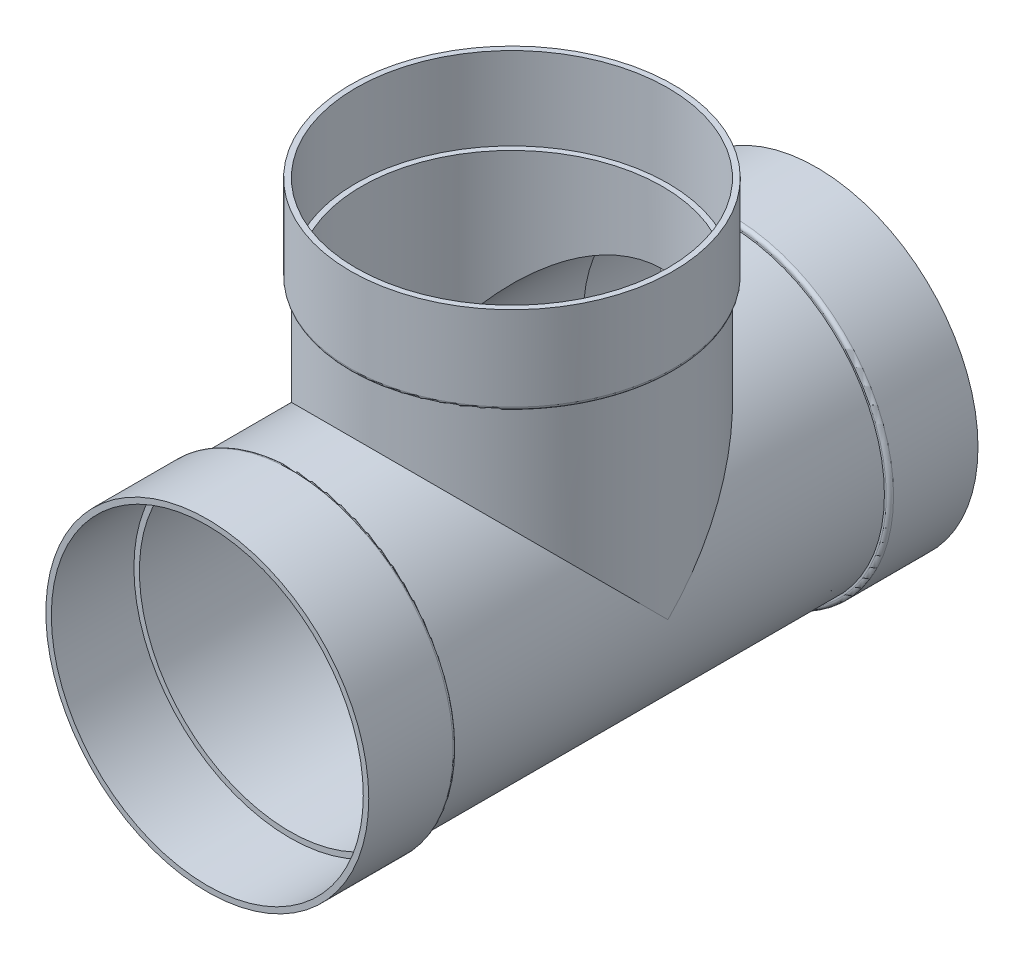
ISO-10303-21;
HEADER;
FILE_DESCRIPTION(('STEP AP214'),'2;1');
FILE_NAME('part.step','',(''),(''),'','','');
FILE_SCHEMA(('AUTOMOTIVE_DESIGN { 1 0 10303 214 1 1 1 1 }'));
ENDSEC;
DATA;
#1=APPLICATION_CONTEXT('core data for automotive mechanical design processes');
#2=APPLICATION_PROTOCOL_DEFINITION('international standard','automotive_design',2000,#1);
#3=PRODUCT_CONTEXT('',#1,'mechanical');
#4=PRODUCT('Part','Part','',(#3));
#5=PRODUCT_RELATED_PRODUCT_CATEGORY('part','',(#4));
#6=PRODUCT_DEFINITION_FORMATION('','',#4);
#7=PRODUCT_DEFINITION_CONTEXT('part definition',#1,'design');
#8=PRODUCT_DEFINITION('design','',#6,#7);
#9=PRODUCT_DEFINITION_SHAPE('','',#8);
#10=(LENGTH_UNIT() NAMED_UNIT(*) SI_UNIT(.MILLI.,.METRE.));
#11=(NAMED_UNIT(*) PLANE_ANGLE_UNIT() SI_UNIT($,.RADIAN.));
#12=(NAMED_UNIT(*) SI_UNIT($,.STERADIAN.) SOLID_ANGLE_UNIT());
#13=UNCERTAINTY_MEASURE_WITH_UNIT(LENGTH_MEASURE(1.E-05),#10,'distance_accuracy_value','');
#14=(GEOMETRIC_REPRESENTATION_CONTEXT(3) GLOBAL_UNCERTAINTY_ASSIGNED_CONTEXT((#13)) GLOBAL_UNIT_ASSIGNED_CONTEXT((#10,
#11,#12)) REPRESENTATION_CONTEXT('',''));
#15=CARTESIAN_POINT('',(0.,0.,0.));
#16=DIRECTION('',(0.,0.,1.));
#17=DIRECTION('',(1.,0.,0.));
#18=AXIS2_PLACEMENT_3D('',#15,#16,#17);
#19=CARTESIAN_POINT('',(0.,0.,263.525));
#20=DIRECTION('',(0.,0.,-1.));
#21=DIRECTION('',(-1.,0.,0.));
#22=AXIS2_PLACEMENT_3D('',#19,#20,#21);
#23=PLANE('',#22);
#24=CARTESIAN_POINT('',(0.,0.,263.525));
#25=DIRECTION('',(0.,0.,-1.));
#26=DIRECTION('',(-1.,0.,0.));
#27=AXIS2_PLACEMENT_3D('',#24,#25,#26);
#28=CIRCLE('',#27,134.9375);
#29=CARTESIAN_POINT('',(-134.9375,0.,263.525));
#30=VERTEX_POINT('',#29);
#31=EDGE_CURVE('E86',#30,#30,#28,.F.);
#32=ORIENTED_EDGE('',*,*,#31,.F.);
#33=EDGE_LOOP('',(#32));
#34=FACE_BOUND('',#33,.T.);
#35=CARTESIAN_POINT('',(0.,0.,263.525));
#36=DIRECTION('',(0.,0.,1.));
#37=DIRECTION('',(1.,0.,0.));
#38=AXIS2_PLACEMENT_3D('',#35,#36,#37);
#39=CIRCLE('',#38,139.6873);
#40=CARTESIAN_POINT('',(139.6873,0.,263.525));
#41=VERTEX_POINT('',#40);
#42=EDGE_CURVE('E143',#41,#41,#39,.T.);
#43=ORIENTED_EDGE('',*,*,#42,.T.);
#44=EDGE_LOOP('',(#43));
#45=FACE_BOUND('',#44,.T.);
#46=ADVANCED_FACE('F53',(#34,#45),#23,.F.);
#47=CARTESIAN_POINT('',(0.,0.,168.70511138535));
#48=DIRECTION('',(0.,0.,1.));
#49=DIRECTION('',(1.,0.,0.));
#50=AXIS2_PLACEMENT_3D('',#47,#48,#49);
#51=CYLINDRICAL_SURFACE('',#50,139.6873);
#52=CARTESIAN_POINT('',(0.,0.,190.5));
#53=DIRECTION('',(0.,0.,1.));
#54=DIRECTION('',(1.,0.,0.));
#55=AXIS2_PLACEMENT_3D('',#52,#53,#54);
#56=CIRCLE('',#55,139.6873);
#57=CARTESIAN_POINT('',(139.6873,0.,190.5));
#58=VERTEX_POINT('',#57);
#59=EDGE_CURVE('E159',#58,#58,#56,.T.);
#60=ORIENTED_EDGE('',*,*,#59,.T.);
#61=EDGE_LOOP('',(#60));
#62=FACE_BOUND('',#61,.T.);
#63=ORIENTED_EDGE('',*,*,#42,.F.);
#64=EDGE_LOOP('',(#63));
#65=FACE_BOUND('',#64,.T.);
#66=ADVANCED_FACE('F184',(#62,#65),#51,.T.);
#67=CARTESIAN_POINT('',(0.,139.6873,187.325));
#68=DIRECTION('',(0.,0.,1.));
#69=DIRECTION('',(1.,0.,0.));
#70=AXIS2_PLACEMENT_3D('',#67,#68,#69);
#71=PLANE('',#70);
#72=CARTESIAN_POINT('',(0.,0.,187.325));
#73=DIRECTION('',(0.,0.,1.));
#74=DIRECTION('',(1.,0.,0.));
#75=AXIS2_PLACEMENT_3D('',#72,#73,#74);
#76=CIRCLE('',#75,136.5123);
#77=CARTESIAN_POINT('',(136.5123,0.,187.325));
#78=VERTEX_POINT('',#77);
#79=EDGE_CURVE('E163',#78,#78,#76,.F.);
#80=ORIENTED_EDGE('',*,*,#79,.T.);
#81=EDGE_LOOP('',(#80));
#82=FACE_BOUND('',#81,.T.);
#83=CARTESIAN_POINT('',(0.,0.,187.325));
#84=DIRECTION('',(0.,0.,1.));
#85=DIRECTION('',(1.,0.,0.));
#86=AXIS2_PLACEMENT_3D('',#83,#84,#85);
#87=CIRCLE('',#86,134.9375);
#88=CARTESIAN_POINT('',(134.9375,0.,187.325));
#89=VERTEX_POINT('',#88);
#90=EDGE_CURVE('E139',#89,#89,#87,.T.);
#91=ORIENTED_EDGE('',*,*,#90,.T.);
#92=EDGE_LOOP('',(#91));
#93=FACE_BOUND('',#92,.T.);
#94=ADVANCED_FACE('F190',(#82,#93),#71,.F.);
#95=CARTESIAN_POINT('',(0.,0.,168.70511138535));
#96=DIRECTION('',(0.,0.,1.));
#97=DIRECTION('',(1.,0.,0.));
#98=AXIS2_PLACEMENT_3D('',#95,#96,#97);
#99=CYLINDRICAL_SURFACE('',#98,134.9375);
#100=CARTESIAN_POINT('',(0.,0.,0.));
#101=DIRECTION('',(0.,-0.707106781186547,0.707106781186547));
#102=DIRECTION('',(0.,0.707106781186547,0.707106781186547));
#103=AXIS2_PLACEMENT_3D('',#100,#101,#102);
#104=ELLIPSE('',#103,190.830442572719,134.9375);
#105=CARTESIAN_POINT('',(134.9375,0.,0.));
#106=VERTEX_POINT('',#105);
#107=CARTESIAN_POINT('',(-134.9375,0.,0.));
#108=VERTEX_POINT('',#107);
#109=EDGE_CURVE('E71',#106,#108,#104,.T.);
#110=ORIENTED_EDGE('',*,*,#109,.T.);
#111=CARTESIAN_POINT('',(0.,0.,0.));
#112=DIRECTION('',(0.,0.707106781186547,0.707106781186547));
#113=DIRECTION('',(0.,-0.707106781186547,0.707106781186547));
#114=AXIS2_PLACEMENT_3D('',#111,#112,#113);
#115=ELLIPSE('',#114,190.830442572719,134.9375);
#116=EDGE_CURVE('E68',#108,#106,#115,.F.);
#117=ORIENTED_EDGE('',*,*,#116,.T.);
#118=EDGE_LOOP('',(#110,#117));
#119=FACE_BOUND('',#118,.T.);
#120=ORIENTED_EDGE('',*,*,#90,.F.);
#121=EDGE_LOOP('',(#120));
#122=FACE_BOUND('',#121,.T.);
#123=CARTESIAN_POINT('',(0.,0.,-187.325));
#124=DIRECTION('',(0.,0.,1.));
#125=DIRECTION('',(1.,0.,0.));
#126=AXIS2_PLACEMENT_3D('',#123,#124,#125);
#127=CIRCLE('',#126,134.9375);
#128=CARTESIAN_POINT('',(134.9375,0.,-187.325));
#129=VERTEX_POINT('',#128);
#130=EDGE_CURVE('E135',#129,#129,#127,.T.);
#131=ORIENTED_EDGE('',*,*,#130,.T.);
#132=EDGE_LOOP('',(#131));
#133=FACE_BOUND('',#132,.T.);
#134=ADVANCED_FACE('F214',(#119,#122,#133),#99,.T.);
#135=CARTESIAN_POINT('',(0.,139.6873,-187.325));
#136=DIRECTION('',(0.,0.,-1.));
#137=DIRECTION('',(-1.,0.,0.));
#138=AXIS2_PLACEMENT_3D('',#135,#136,#137);
#139=PLANE('',#138);
#140=CARTESIAN_POINT('',(0.,0.,-187.325));
#141=DIRECTION('',(0.,0.,-1.));
#142=DIRECTION('',(-1.,0.,0.));
#143=AXIS2_PLACEMENT_3D('',#140,#141,#142);
#144=CIRCLE('',#143,136.5123);
#145=CARTESIAN_POINT('',(-136.5123,0.,-187.325));
#146=VERTEX_POINT('',#145);
#147=EDGE_CURVE('E151',#146,#146,#144,.F.);
#148=ORIENTED_EDGE('',*,*,#147,.T.);
#149=EDGE_LOOP('',(#148));
#150=FACE_BOUND('',#149,.T.);
#151=ORIENTED_EDGE('',*,*,#130,.F.);
#152=EDGE_LOOP('',(#151));
#153=FACE_BOUND('',#152,.T.);
#154=ADVANCED_FACE('F210',(#150,#153),#139,.F.);
#155=CARTESIAN_POINT('',(0.,0.,168.70511138535));
#156=DIRECTION('',(0.,0.,1.));
#157=DIRECTION('',(1.,0.,0.));
#158=AXIS2_PLACEMENT_3D('',#155,#156,#157);
#159=CYLINDRICAL_SURFACE('',#158,139.6873);
#160=CARTESIAN_POINT('',(0.,0.,-190.5));
#161=DIRECTION('',(0.,0.,-1.));
#162=DIRECTION('',(-1.,0.,0.));
#163=AXIS2_PLACEMENT_3D('',#160,#161,#162);
#164=CIRCLE('',#163,139.6873);
#165=CARTESIAN_POINT('',(-139.6873,0.,-190.5));
#166=VERTEX_POINT('',#165);
#167=EDGE_CURVE('E155',#166,#166,#164,.T.);
#168=ORIENTED_EDGE('',*,*,#167,.T.);
#169=EDGE_LOOP('',(#168));
#170=FACE_BOUND('',#169,.T.);
#171=CARTESIAN_POINT('',(0.,0.,-263.525));
#172=DIRECTION('',(0.,0.,1.));
#173=DIRECTION('',(1.,0.,0.));
#174=AXIS2_PLACEMENT_3D('',#171,#172,#173);
#175=CIRCLE('',#174,139.6873);
#176=CARTESIAN_POINT('',(139.6873,0.,-263.525));
#177=VERTEX_POINT('',#176);
#178=EDGE_CURVE('E131',#177,#177,#175,.T.);
#179=ORIENTED_EDGE('',*,*,#178,.T.);
#180=EDGE_LOOP('',(#179));
#181=FACE_BOUND('',#180,.T.);
#182=ADVANCED_FACE('F213',(#170,#181),#159,.T.);
#183=CARTESIAN_POINT('',(0.,139.6873,-263.525));
#184=DIRECTION('',(0.,0.,1.));
#185=DIRECTION('',(1.,0.,0.));
#186=AXIS2_PLACEMENT_3D('',#183,#184,#185);
#187=PLANE('',#186);
#188=CARTESIAN_POINT('',(0.,0.,-263.525));
#189=DIRECTION('',(0.,0.,1.));
#190=DIRECTION('',(1.,0.,0.));
#191=AXIS2_PLACEMENT_3D('',#188,#189,#190);
#192=CIRCLE('',#191,134.9375);
#193=CARTESIAN_POINT('',(134.9375,0.,-263.525));
#194=VERTEX_POINT('',#193);
#195=EDGE_CURVE('E108',#194,#194,#192,.T.);
#196=ORIENTED_EDGE('',*,*,#195,.T.);
#197=EDGE_LOOP('',(#196));
#198=FACE_BOUND('',#197,.T.);
#199=ORIENTED_EDGE('',*,*,#178,.F.);
#200=EDGE_LOOP('',(#199));
#201=FACE_BOUND('',#200,.T.);
#202=ADVANCED_FACE('F229',(#198,#201),#187,.F.);
#203=CARTESIAN_POINT('',(0.,0.,0.));
#204=DIRECTION('',(0.,1.,0.));
#205=DIRECTION('',(0.,0.,1.));
#206=AXIS2_PLACEMENT_3D('',#203,#204,#205);
#207=CYLINDRICAL_SURFACE('',#206,134.9375);
#208=CARTESIAN_POINT('',(0.,187.325,0.));
#209=DIRECTION('',(0.,1.,0.));
#210=DIRECTION('',(0.,0.,1.));
#211=AXIS2_PLACEMENT_3D('',#208,#209,#210);
#212=CIRCLE('',#211,134.9375);
#213=CARTESIAN_POINT('',(0.,187.325,134.9375));
#214=VERTEX_POINT('',#213);
#215=EDGE_CURVE('E90',#214,#214,#212,.T.);
#216=ORIENTED_EDGE('',*,*,#215,.F.);
#217=EDGE_LOOP('',(#216));
#218=FACE_BOUND('',#217,.T.);
#219=ORIENTED_EDGE('',*,*,#116,.F.);
#220=ORIENTED_EDGE('',*,*,#109,.F.);
#221=EDGE_LOOP('',(#219,#220));
#222=FACE_BOUND('',#221,.T.);
#223=ADVANCED_FACE('F233',(#218,#222),#207,.T.);
#224=CARTESIAN_POINT('',(0.,263.525,0.));
#225=DIRECTION('',(0.,1.,0.));
#226=DIRECTION('',(0.,0.,1.));
#227=AXIS2_PLACEMENT_3D('',#224,#225,#226);
#228=PLANE('',#227);
#229=CARTESIAN_POINT('',(0.,263.525,0.));
#230=DIRECTION('',(0.,1.,0.));
#231=DIRECTION('',(0.,0.,1.));
#232=AXIS2_PLACEMENT_3D('',#229,#230,#231);
#233=CIRCLE('',#232,134.9375);
#234=CARTESIAN_POINT('',(0.,263.525,134.9375));
#235=VERTEX_POINT('',#234);
#236=EDGE_CURVE('E117',#235,#235,#233,.T.);
#237=ORIENTED_EDGE('',*,*,#236,.F.);
#238=EDGE_LOOP('',(#237));
#239=FACE_BOUND('',#238,.T.);
#240=CARTESIAN_POINT('',(0.,263.525,0.));
#241=DIRECTION('',(0.,1.,0.));
#242=DIRECTION('',(0.,0.,1.));
#243=AXIS2_PLACEMENT_3D('',#240,#241,#242);
#244=CIRCLE('',#243,139.6873);
#245=CARTESIAN_POINT('',(0.,263.525,139.6873));
#246=VERTEX_POINT('',#245);
#247=EDGE_CURVE('E95',#246,#246,#244,.T.);
#248=ORIENTED_EDGE('',*,*,#247,.T.);
#249=EDGE_LOOP('',(#248));
#250=FACE_BOUND('',#249,.T.);
#251=ADVANCED_FACE('F235',(#239,#250),#228,.T.);
#252=CARTESIAN_POINT('',(0.,0.,0.));
#253=DIRECTION('',(0.,1.,0.));
#254=DIRECTION('',(0.,0.,1.));
#255=AXIS2_PLACEMENT_3D('',#252,#253,#254);
#256=CYLINDRICAL_SURFACE('',#255,139.6873);
#257=CARTESIAN_POINT('',(0.,190.5,0.));
#258=DIRECTION('',(0.,-1.,0.));
#259=DIRECTION('',(0.,0.,-1.));
#260=AXIS2_PLACEMENT_3D('',#257,#258,#259);
#261=CIRCLE('',#260,139.6873);
#262=CARTESIAN_POINT('',(0.,190.5,-139.6873));
#263=VERTEX_POINT('',#262);
#264=EDGE_CURVE('E62',#263,#263,#261,.F.);
#265=ORIENTED_EDGE('',*,*,#264,.T.);
#266=EDGE_LOOP('',(#265));
#267=FACE_BOUND('',#266,.T.);
#268=ORIENTED_EDGE('',*,*,#247,.F.);
#269=EDGE_LOOP('',(#268));
#270=FACE_BOUND('',#269,.T.);
#271=ADVANCED_FACE('F171',(#267,#270),#256,.T.);
#272=CARTESIAN_POINT('',(0.,187.325,139.6873));
#273=DIRECTION('',(0.,-1.,0.));
#274=DIRECTION('',(0.,0.,-1.));
#275=AXIS2_PLACEMENT_3D('',#272,#273,#274);
#276=PLANE('',#275);
#277=CARTESIAN_POINT('',(0.,187.325,0.));
#278=DIRECTION('',(0.,-1.,0.));
#279=DIRECTION('',(0.,0.,-1.));
#280=AXIS2_PLACEMENT_3D('',#277,#278,#279);
#281=CIRCLE('',#280,136.5123);
#282=CARTESIAN_POINT('',(0.,187.325,-136.5123));
#283=VERTEX_POINT('',#282);
#284=EDGE_CURVE('E13',#283,#283,#281,.T.);
#285=ORIENTED_EDGE('',*,*,#284,.T.);
#286=EDGE_LOOP('',(#285));
#287=FACE_BOUND('',#286,.T.);
#288=ORIENTED_EDGE('',*,*,#215,.T.);
#289=EDGE_LOOP('',(#288));
#290=FACE_BOUND('',#289,.T.);
#291=ADVANCED_FACE('F241',(#287,#290),#276,.T.);
#292=CARTESIAN_POINT('',(0.,0.,168.70511138535));
#293=DIRECTION('',(0.,0.,1.));
#294=DIRECTION('',(1.,0.,0.));
#295=AXIS2_PLACEMENT_3D('',#292,#293,#294);
#296=CYLINDRICAL_SURFACE('',#295,134.9375);
#297=ORIENTED_EDGE('',*,*,#31,.T.);
#298=EDGE_LOOP('',(#297));
#299=FACE_BOUND('',#298,.T.);
#300=CARTESIAN_POINT('',(0.,0.,192.0748));
#301=DIRECTION('',(0.,0.,1.));
#302=DIRECTION('',(1.,0.,0.));
#303=AXIS2_PLACEMENT_3D('',#300,#301,#302);
#304=CIRCLE('',#303,134.9375);
#305=CARTESIAN_POINT('',(134.9375,0.,192.0748));
#306=VERTEX_POINT('',#305);
#307=EDGE_CURVE('E121',#306,#306,#304,.T.);
#308=ORIENTED_EDGE('',*,*,#307,.F.);
#309=EDGE_LOOP('',(#308));
#310=FACE_BOUND('',#309,.T.);
#311=ADVANCED_FACE('F244',(#299,#310),#296,.F.);
#312=CARTESIAN_POINT('',(0.,139.6873,192.0748));
#313=DIRECTION('',(0.,0.,1.));
#314=DIRECTION('',(1.,0.,0.));
#315=AXIS2_PLACEMENT_3D('',#312,#313,#314);
#316=PLANE('',#315);
#317=ORIENTED_EDGE('',*,*,#307,.T.);
#318=EDGE_LOOP('',(#317));
#319=FACE_BOUND('',#318,.T.);
#320=CARTESIAN_POINT('',(0.,0.,192.0748));
#321=DIRECTION('',(0.,0.,1.));
#322=DIRECTION('',(1.,0.,0.));
#323=AXIS2_PLACEMENT_3D('',#320,#321,#322);
#324=CIRCLE('',#323,130.1877);
#325=CARTESIAN_POINT('',(130.1877,0.,192.0748));
#326=VERTEX_POINT('',#325);
#327=EDGE_CURVE('E103',#326,#326,#324,.T.);
#328=ORIENTED_EDGE('',*,*,#327,.F.);
#329=EDGE_LOOP('',(#328));
#330=FACE_BOUND('',#329,.T.);
#331=ADVANCED_FACE('F265',(#319,#330),#316,.T.);
#332=CARTESIAN_POINT('',(0.,0.,168.70511138535));
#333=DIRECTION('',(0.,0.,1.));
#334=DIRECTION('',(1.,0.,0.));
#335=AXIS2_PLACEMENT_3D('',#332,#333,#334);
#336=CYLINDRICAL_SURFACE('',#335,130.1877);
#337=CARTESIAN_POINT('',(0.,0.,0.));
#338=DIRECTION('',(0.,-0.707106781186547,0.707106781186547));
#339=DIRECTION('',(0.,0.707106781186547,0.707106781186547));
#340=AXIS2_PLACEMENT_3D('',#337,#338,#339);
#341=ELLIPSE('',#340,184.11321099416,130.1877);
#342=CARTESIAN_POINT('',(130.1877,0.,0.));
#343=VERTEX_POINT('',#342);
#344=CARTESIAN_POINT('',(-130.1877,0.,0.));
#345=VERTEX_POINT('',#344);
#346=EDGE_CURVE('E79',#343,#345,#341,.T.);
#347=ORIENTED_EDGE('',*,*,#346,.F.);
#348=CARTESIAN_POINT('',(0.,0.,0.));
#349=DIRECTION('',(0.,0.707106781186547,0.707106781186547));
#350=DIRECTION('',(0.,-0.707106781186547,0.707106781186547));
#351=AXIS2_PLACEMENT_3D('',#348,#349,#350);
#352=ELLIPSE('',#351,184.11321099416,130.1877);
#353=EDGE_CURVE('E83',#345,#343,#352,.F.);
#354=ORIENTED_EDGE('',*,*,#353,.F.);
#355=EDGE_LOOP('',(#347,#354));
#356=FACE_BOUND('',#355,.T.);
#357=ORIENTED_EDGE('',*,*,#327,.T.);
#358=EDGE_LOOP('',(#357));
#359=FACE_BOUND('',#358,.T.);
#360=CARTESIAN_POINT('',(0.,0.,-192.0748));
#361=DIRECTION('',(0.,0.,-1.));
#362=DIRECTION('',(-1.,0.,0.));
#363=AXIS2_PLACEMENT_3D('',#360,#361,#362);
#364=CIRCLE('',#363,130.1877);
#365=CARTESIAN_POINT('',(-130.1877,0.,-192.0748));
#366=VERTEX_POINT('',#365);
#367=EDGE_CURVE('E99',#366,#366,#364,.F.);
#368=ORIENTED_EDGE('',*,*,#367,.F.);
#369=EDGE_LOOP('',(#368));
#370=FACE_BOUND('',#369,.T.);
#371=ADVANCED_FACE('F81',(#356,#359,#370),#336,.F.);
#372=CARTESIAN_POINT('',(0.,139.6873,-192.0748));
#373=DIRECTION('',(0.,0.,-1.));
#374=DIRECTION('',(-1.,0.,0.));
#375=AXIS2_PLACEMENT_3D('',#372,#373,#374);
#376=PLANE('',#375);
#377=ORIENTED_EDGE('',*,*,#367,.T.);
#378=EDGE_LOOP('',(#377));
#379=FACE_BOUND('',#378,.T.);
#380=CARTESIAN_POINT('',(0.,0.,-192.0748));
#381=DIRECTION('',(0.,0.,-1.));
#382=DIRECTION('',(-1.,0.,0.));
#383=AXIS2_PLACEMENT_3D('',#380,#381,#382);
#384=CIRCLE('',#383,134.9375);
#385=CARTESIAN_POINT('',(-134.9375,0.,-192.0748));
#386=VERTEX_POINT('',#385);
#387=EDGE_CURVE('E104',#386,#386,#384,.F.);
#388=ORIENTED_EDGE('',*,*,#387,.F.);
#389=EDGE_LOOP('',(#388));
#390=FACE_BOUND('',#389,.T.);
#391=ADVANCED_FACE('F258',(#379,#390),#376,.T.);
#392=CARTESIAN_POINT('',(0.,0.,168.70511138535));
#393=DIRECTION('',(0.,0.,1.));
#394=DIRECTION('',(1.,0.,0.));
#395=AXIS2_PLACEMENT_3D('',#392,#393,#394);
#396=CYLINDRICAL_SURFACE('',#395,134.9375);
#397=ORIENTED_EDGE('',*,*,#387,.T.);
#398=EDGE_LOOP('',(#397));
#399=FACE_BOUND('',#398,.T.);
#400=ORIENTED_EDGE('',*,*,#195,.F.);
#401=EDGE_LOOP('',(#400));
#402=FACE_BOUND('',#401,.T.);
#403=ADVANCED_FACE('F254',(#399,#402),#396,.F.);
#404=CARTESIAN_POINT('',(0.,0.,0.));
#405=DIRECTION('',(0.,1.,0.));
#406=DIRECTION('',(0.,0.,1.));
#407=AXIS2_PLACEMENT_3D('',#404,#405,#406);
#408=CYLINDRICAL_SURFACE('',#407,130.1877);
#409=CARTESIAN_POINT('',(0.,192.0748,0.));
#410=DIRECTION('',(0.,-1.,0.));
#411=DIRECTION('',(0.,0.,-1.));
#412=AXIS2_PLACEMENT_3D('',#409,#410,#411);
#413=CIRCLE('',#412,130.1877);
#414=CARTESIAN_POINT('',(0.,192.0748,-130.1877));
#415=VERTEX_POINT('',#414);
#416=EDGE_CURVE('E109',#415,#415,#413,.F.);
#417=ORIENTED_EDGE('',*,*,#416,.T.);
#418=EDGE_LOOP('',(#417));
#419=FACE_BOUND('',#418,.T.);
#420=ORIENTED_EDGE('',*,*,#353,.T.);
#421=ORIENTED_EDGE('',*,*,#346,.T.);
#422=EDGE_LOOP('',(#420,#421));
#423=FACE_BOUND('',#422,.T.);
#424=ADVANCED_FACE('F88',(#419,#423),#408,.F.);
#425=CARTESIAN_POINT('',(0.,0.,0.));
#426=DIRECTION('',(0.,1.,0.));
#427=DIRECTION('',(0.,0.,1.));
#428=AXIS2_PLACEMENT_3D('',#425,#426,#427);
#429=CYLINDRICAL_SURFACE('',#428,134.9375);
#430=CARTESIAN_POINT('',(0.,192.0748,0.));
#431=DIRECTION('',(0.,-1.,0.));
#432=DIRECTION('',(0.,0.,-1.));
#433=AXIS2_PLACEMENT_3D('',#430,#431,#432);
#434=CIRCLE('',#433,134.9375);
#435=CARTESIAN_POINT('',(0.,192.0748,-134.9375));
#436=VERTEX_POINT('',#435);
#437=EDGE_CURVE('E113',#436,#436,#434,.F.);
#438=ORIENTED_EDGE('',*,*,#437,.F.);
#439=EDGE_LOOP('',(#438));
#440=FACE_BOUND('',#439,.T.);
#441=ORIENTED_EDGE('',*,*,#236,.T.);
#442=EDGE_LOOP('',(#441));
#443=FACE_BOUND('',#442,.T.);
#444=ADVANCED_FACE('F203',(#440,#443),#429,.F.);
#445=CARTESIAN_POINT('',(0.,192.0748,139.6873));
#446=DIRECTION('',(0.,-1.,0.));
#447=DIRECTION('',(0.,0.,-1.));
#448=AXIS2_PLACEMENT_3D('',#445,#446,#447);
#449=PLANE('',#448);
#450=ORIENTED_EDGE('',*,*,#416,.F.);
#451=EDGE_LOOP('',(#450));
#452=FACE_BOUND('',#451,.T.);
#453=ORIENTED_EDGE('',*,*,#437,.T.);
#454=EDGE_LOOP('',(#453));
#455=FACE_BOUND('',#454,.T.);
#456=ADVANCED_FACE('F198',(#452,#455),#449,.F.);
#457=CARTESIAN_POINT('',(0.,0.,-190.5));
#458=DIRECTION('',(0.,0.,-1.));
#459=DIRECTION('',(-1.,0.,0.));
#460=AXIS2_PLACEMENT_3D('',#457,#458,#459);
#461=TOROIDAL_SURFACE('',#460,136.5123,3.175);
#462=ORIENTED_EDGE('',*,*,#167,.F.);
#463=EDGE_LOOP('',(#462));
#464=FACE_BOUND('',#463,.T.);
#465=ORIENTED_EDGE('',*,*,#147,.F.);
#466=EDGE_LOOP('',(#465));
#467=FACE_BOUND('',#466,.T.);
#468=ADVANCED_FACE('F180',(#464,#467),#461,.T.);
#469=CARTESIAN_POINT('',(0.,0.,190.5));
#470=DIRECTION('',(0.,0.,1.));
#471=DIRECTION('',(1.,0.,0.));
#472=AXIS2_PLACEMENT_3D('',#469,#470,#471);
#473=TOROIDAL_SURFACE('',#472,136.5123,3.175);
#474=ORIENTED_EDGE('',*,*,#79,.F.);
#475=EDGE_LOOP('',(#474));
#476=FACE_BOUND('',#475,.T.);
#477=ORIENTED_EDGE('',*,*,#59,.F.);
#478=EDGE_LOOP('',(#477));
#479=FACE_BOUND('',#478,.T.);
#480=ADVANCED_FACE('F175',(#476,#479),#473,.T.);
#481=CARTESIAN_POINT('',(0.,190.5,0.));
#482=DIRECTION('',(0.,-1.,0.));
#483=DIRECTION('',(0.,0.,-1.));
#484=AXIS2_PLACEMENT_3D('',#481,#482,#483);
#485=TOROIDAL_SURFACE('',#484,136.5123,3.175);
#486=ORIENTED_EDGE('',*,*,#284,.F.);
#487=EDGE_LOOP('',(#486));
#488=FACE_BOUND('',#487,.T.);
#489=ORIENTED_EDGE('',*,*,#264,.F.);
#490=EDGE_LOOP('',(#489));
#491=FACE_BOUND('',#490,.T.);
#492=ADVANCED_FACE('F55',(#488,#491),#485,.T.);
#493=CLOSED_SHELL('',(#46,#66,#94,#134,#154,#182,#202,#223,#251,#271,#291,#311,#331,#371,#391,
#403,#424,#444,#456,#468,#480,#492));
#494=MANIFOLD_SOLID_BREP('B2',#493);
#495=ADVANCED_BREP_SHAPE_REPRESENTATION('',(#18,#494),#14);
#496=SHAPE_DEFINITION_REPRESENTATION(#9,#495);
ENDSEC;
END-ISO-10303-21;
